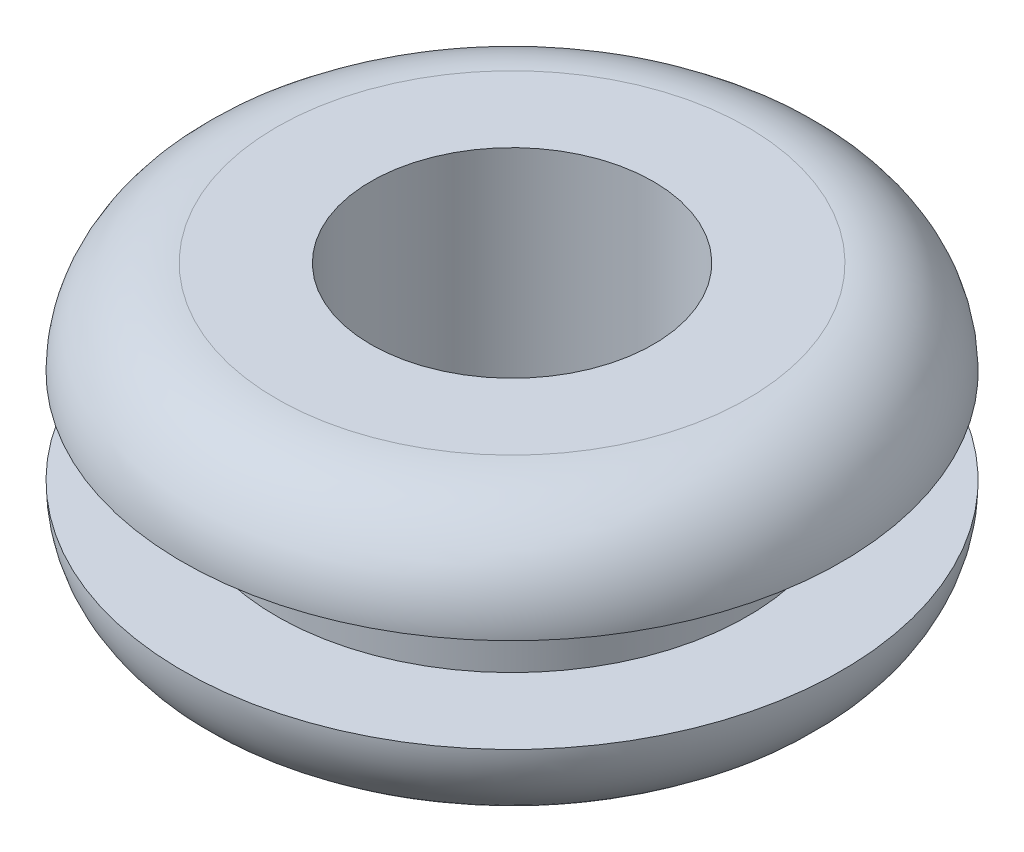
ISO-10303-21;
HEADER;
FILE_DESCRIPTION(('STEP AP214'),'2;1');
FILE_NAME('part.step','',(''),(''),'','','');
FILE_SCHEMA(('AUTOMOTIVE_DESIGN { 1 0 10303 214 1 1 1 1 }'));
ENDSEC;
DATA;
#1=APPLICATION_CONTEXT('core data for automotive mechanical design processes');
#2=APPLICATION_PROTOCOL_DEFINITION('international standard','automotive_design',2000,#1);
#3=PRODUCT_CONTEXT('',#1,'mechanical');
#4=PRODUCT('Part','Part','',(#3));
#5=PRODUCT_RELATED_PRODUCT_CATEGORY('part','',(#4));
#6=PRODUCT_DEFINITION_FORMATION('','',#4);
#7=PRODUCT_DEFINITION_CONTEXT('part definition',#1,'design');
#8=PRODUCT_DEFINITION('design','',#6,#7);
#9=PRODUCT_DEFINITION_SHAPE('','',#8);
#10=(LENGTH_UNIT() NAMED_UNIT(*) SI_UNIT(.MILLI.,.METRE.));
#11=(NAMED_UNIT(*) PLANE_ANGLE_UNIT() SI_UNIT($,.RADIAN.));
#12=(NAMED_UNIT(*) SI_UNIT($,.STERADIAN.) SOLID_ANGLE_UNIT());
#13=UNCERTAINTY_MEASURE_WITH_UNIT(LENGTH_MEASURE(1.E-05),#10,'distance_accuracy_value','');
#14=(GEOMETRIC_REPRESENTATION_CONTEXT(3) GLOBAL_UNCERTAINTY_ASSIGNED_CONTEXT((#13)) GLOBAL_UNIT_ASSIGNED_CONTEXT((#10,
#11,#12)) REPRESENTATION_CONTEXT('',''));
#15=CARTESIAN_POINT('',(0.,0.,0.));
#16=DIRECTION('',(0.,0.,1.));
#17=DIRECTION('',(1.,0.,0.));
#18=AXIS2_PLACEMENT_3D('',#15,#16,#17);
#19=CARTESIAN_POINT('',(0.933751392986012,3.175,0.));
#20=DIRECTION('',(0.,1.,0.));
#21=DIRECTION('',(0.,0.,1.));
#22=AXIS2_PLACEMENT_3D('',#19,#20,#21);
#23=TOROIDAL_SURFACE('',#22,7.9375,3.175);
#24=CARTESIAN_POINT('',(0.933751392986011,6.35,0.));
#25=DIRECTION('',(0.,-1.,0.));
#26=DIRECTION('',(-1.,0.,0.));
#27=AXIS2_PLACEMENT_3D('',#24,#25,#26);
#28=CIRCLE('',#27,7.9375);
#29=CARTESIAN_POINT('',(-7.00374860701399,6.35,0.));
#30=VERTEX_POINT('',#29);
#31=EDGE_CURVE('E46',#30,#30,#28,.F.);
#32=ORIENTED_EDGE('',*,*,#31,.F.);
#33=EDGE_LOOP('',(#32));
#34=FACE_BOUND('',#33,.T.);
#35=CARTESIAN_POINT('',(0.933751392986012,3.175,0.));
#36=DIRECTION('',(0.,1.,0.));
#37=DIRECTION('',(-1.,0.,0.));
#38=AXIS2_PLACEMENT_3D('',#35,#36,#37);
#39=CIRCLE('',#38,11.1125);
#40=CARTESIAN_POINT('',(-10.178748607014,3.175,0.));
#41=VERTEX_POINT('',#40);
#42=EDGE_CURVE('E19',#41,#41,#39,.F.);
#43=ORIENTED_EDGE('',*,*,#42,.F.);
#44=EDGE_LOOP('',(#43));
#45=FACE_BOUND('',#44,.T.);
#46=ADVANCED_FACE('F15',(#34,#45),#23,.T.);
#47=CARTESIAN_POINT('',(-4.62249860701399,6.35,0.));
#48=DIRECTION('',(0.,1.,0.));
#49=DIRECTION('',(0.,0.,1.));
#50=AXIS2_PLACEMENT_3D('',#47,#48,#49);
#51=PLANE('',#50);
#52=CARTESIAN_POINT('',(0.933751392986012,6.35,0.));
#53=DIRECTION('',(0.,-1.,0.));
#54=DIRECTION('',(0.,0.,-1.));
#55=AXIS2_PLACEMENT_3D('',#52,#53,#54);
#56=CIRCLE('',#55,4.7625);
#57=CARTESIAN_POINT('',(0.933751392986012,6.35,-4.7625));
#58=VERTEX_POINT('',#57);
#59=EDGE_CURVE('E41',#58,#58,#56,.T.);
#60=ORIENTED_EDGE('',*,*,#59,.T.);
#61=EDGE_LOOP('',(#60));
#62=FACE_BOUND('',#61,.T.);
#63=ORIENTED_EDGE('',*,*,#31,.T.);
#64=EDGE_LOOP('',(#63));
#65=FACE_BOUND('',#64,.T.);
#66=ADVANCED_FACE('F53',(#62,#65),#51,.T.);
#67=CARTESIAN_POINT('',(-8.59124860701399,3.175,0.));
#68=DIRECTION('',(0.,-1.,0.));
#69=DIRECTION('',(0.,0.,-1.));
#70=AXIS2_PLACEMENT_3D('',#67,#68,#69);
#71=PLANE('',#70);
#72=CARTESIAN_POINT('',(0.933751392986011,3.175,0.));
#73=DIRECTION('',(0.,1.,0.));
#74=DIRECTION('',(-1.,0.,0.));
#75=AXIS2_PLACEMENT_3D('',#72,#73,#74);
#76=CIRCLE('',#75,7.9375);
#77=CARTESIAN_POINT('',(-7.00374860701399,3.175,0.));
#78=VERTEX_POINT('',#77);
#79=EDGE_CURVE('E39',#78,#78,#76,.F.);
#80=ORIENTED_EDGE('',*,*,#79,.F.);
#81=EDGE_LOOP('',(#80));
#82=FACE_BOUND('',#81,.T.);
#83=ORIENTED_EDGE('',*,*,#42,.T.);
#84=EDGE_LOOP('',(#83));
#85=FACE_BOUND('',#84,.T.);
#86=ADVANCED_FACE('F74',(#82,#85),#71,.T.);
#87=CARTESIAN_POINT('',(0.933751392986012,6.35,0.));
#88=DIRECTION('',(0.,-1.,0.));
#89=DIRECTION('',(0.,0.,-1.));
#90=AXIS2_PLACEMENT_3D('',#87,#88,#89);
#91=CYLINDRICAL_SURFACE('',#90,4.7625);
#92=ORIENTED_EDGE('',*,*,#59,.F.);
#93=EDGE_LOOP('',(#92));
#94=FACE_BOUND('',#93,.T.);
#95=CARTESIAN_POINT('',(0.933751392986012,-3.175,0.));
#96=DIRECTION('',(0.,-1.,0.));
#97=DIRECTION('',(0.,0.,-1.));
#98=AXIS2_PLACEMENT_3D('',#95,#96,#97);
#99=CIRCLE('',#98,4.7625);
#100=CARTESIAN_POINT('',(0.933751392986012,-3.175,-4.7625));
#101=VERTEX_POINT('',#100);
#102=EDGE_CURVE('E36',#101,#101,#99,.F.);
#103=ORIENTED_EDGE('',*,*,#102,.F.);
#104=EDGE_LOOP('',(#103));
#105=FACE_BOUND('',#104,.T.);
#106=ADVANCED_FACE('F17',(#94,#105),#91,.F.);
#107=CARTESIAN_POINT('',(0.933751392986012,1.5875,0.));
#108=DIRECTION('',(0.,1.,0.));
#109=DIRECTION('',(-1.,0.,0.));
#110=AXIS2_PLACEMENT_3D('',#107,#108,#109);
#111=CYLINDRICAL_SURFACE('',#110,7.9375);
#112=CARTESIAN_POINT('',(0.933751392986012,0.,0.));
#113=DIRECTION('',(0.,1.,0.));
#114=DIRECTION('',(-1.,0.,0.));
#115=AXIS2_PLACEMENT_3D('',#112,#113,#114);
#116=CIRCLE('',#115,7.9375);
#117=CARTESIAN_POINT('',(-7.00374860701399,0.,0.));
#118=VERTEX_POINT('',#117);
#119=EDGE_CURVE('E28',#118,#118,#116,.F.);
#120=ORIENTED_EDGE('',*,*,#119,.F.);
#121=EDGE_LOOP('',(#120));
#122=FACE_BOUND('',#121,.T.);
#123=ORIENTED_EDGE('',*,*,#79,.T.);
#124=EDGE_LOOP('',(#123));
#125=FACE_BOUND('',#124,.T.);
#126=ADVANCED_FACE('F109',(#122,#125),#111,.T.);
#127=CARTESIAN_POINT('',(-4.62249860701399,-3.175,0.));
#128=DIRECTION('',(0.,-1.,0.));
#129=DIRECTION('',(0.,0.,-1.));
#130=AXIS2_PLACEMENT_3D('',#127,#128,#129);
#131=PLANE('',#130);
#132=ORIENTED_EDGE('',*,*,#102,.T.);
#133=EDGE_LOOP('',(#132));
#134=FACE_BOUND('',#133,.T.);
#135=CARTESIAN_POINT('',(0.933751392986012,-3.175,0.));
#136=DIRECTION('',(0.,1.,0.));
#137=DIRECTION('',(-1.,0.,0.));
#138=AXIS2_PLACEMENT_3D('',#135,#136,#137);
#139=CIRCLE('',#138,7.9375);
#140=CARTESIAN_POINT('',(-7.00374860701399,-3.175,0.));
#141=VERTEX_POINT('',#140);
#142=EDGE_CURVE('E23',#141,#141,#139,.T.);
#143=ORIENTED_EDGE('',*,*,#142,.F.);
#144=EDGE_LOOP('',(#143));
#145=FACE_BOUND('',#144,.T.);
#146=ADVANCED_FACE('F88',(#134,#145),#131,.T.);
#147=CARTESIAN_POINT('',(-8.59124860701399,0.,0.));
#148=DIRECTION('',(0.,1.,0.));
#149=DIRECTION('',(0.,0.,1.));
#150=AXIS2_PLACEMENT_3D('',#147,#148,#149);
#151=PLANE('',#150);
#152=ORIENTED_EDGE('',*,*,#119,.T.);
#153=EDGE_LOOP('',(#152));
#154=FACE_BOUND('',#153,.T.);
#155=CARTESIAN_POINT('',(0.933751392986012,0.,0.));
#156=DIRECTION('',(0.,1.,0.));
#157=DIRECTION('',(-1.,0.,0.));
#158=AXIS2_PLACEMENT_3D('',#155,#156,#157);
#159=CIRCLE('',#158,11.1125);
#160=CARTESIAN_POINT('',(-10.178748607014,0.,0.));
#161=VERTEX_POINT('',#160);
#162=EDGE_CURVE('E10',#161,#161,#159,.F.);
#163=ORIENTED_EDGE('',*,*,#162,.F.);
#164=EDGE_LOOP('',(#163));
#165=FACE_BOUND('',#164,.T.);
#166=ADVANCED_FACE('F84',(#154,#165),#151,.T.);
#167=CARTESIAN_POINT('',(0.933751392986012,0.,0.));
#168=DIRECTION('',(0.,1.,0.));
#169=DIRECTION('',(0.,0.,1.));
#170=AXIS2_PLACEMENT_3D('',#167,#168,#169);
#171=TOROIDAL_SURFACE('',#170,7.9375,3.175);
#172=ORIENTED_EDGE('',*,*,#162,.T.);
#173=EDGE_LOOP('',(#172));
#174=FACE_BOUND('',#173,.T.);
#175=ORIENTED_EDGE('',*,*,#142,.T.);
#176=EDGE_LOOP('',(#175));
#177=FACE_BOUND('',#176,.T.);
#178=ADVANCED_FACE('F82',(#174,#177),#171,.T.);
#179=CLOSED_SHELL('',(#46,#66,#86,#106,#126,#146,#166,#178));
#180=MANIFOLD_SOLID_BREP('B1',#179);
#181=ADVANCED_BREP_SHAPE_REPRESENTATION('',(#18,#180),#14);
#182=SHAPE_DEFINITION_REPRESENTATION(#9,#181);
ENDSEC;
END-ISO-10303-21;
